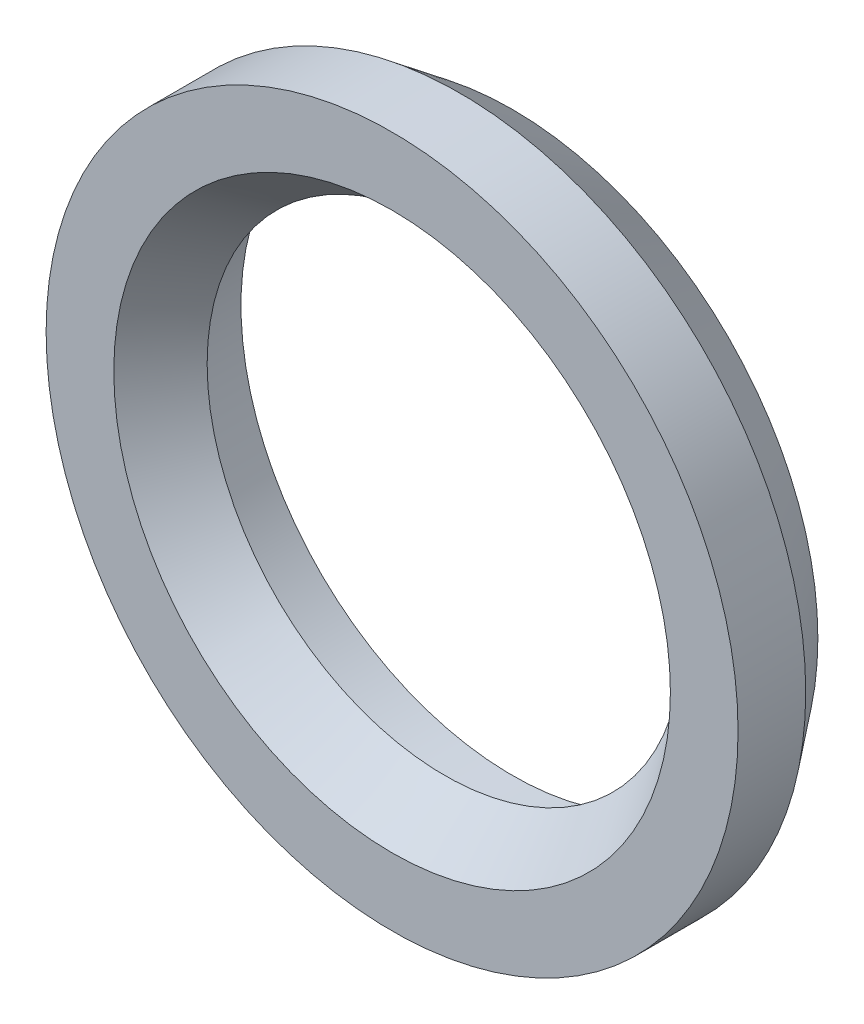
ISO-10303-21;
HEADER;
FILE_DESCRIPTION(('STEP AP214'),'2;1');
FILE_NAME('part.step','',(''),(''),'','','');
FILE_SCHEMA(('AUTOMOTIVE_DESIGN { 1 0 10303 214 1 1 1 1 }'));
ENDSEC;
DATA;
#1=APPLICATION_CONTEXT('core data for automotive mechanical design processes');
#2=APPLICATION_PROTOCOL_DEFINITION('international standard','automotive_design',2000,#1);
#3=PRODUCT_CONTEXT('',#1,'mechanical');
#4=PRODUCT('Part','Part','',(#3));
#5=PRODUCT_RELATED_PRODUCT_CATEGORY('part','',(#4));
#6=PRODUCT_DEFINITION_FORMATION('','',#4);
#7=PRODUCT_DEFINITION_CONTEXT('part definition',#1,'design');
#8=PRODUCT_DEFINITION('design','',#6,#7);
#9=PRODUCT_DEFINITION_SHAPE('','',#8);
#10=(LENGTH_UNIT() NAMED_UNIT(*) SI_UNIT(.MILLI.,.METRE.));
#11=(NAMED_UNIT(*) PLANE_ANGLE_UNIT() SI_UNIT($,.RADIAN.));
#12=(NAMED_UNIT(*) SI_UNIT($,.STERADIAN.) SOLID_ANGLE_UNIT());
#13=UNCERTAINTY_MEASURE_WITH_UNIT(LENGTH_MEASURE(1.E-05),#10,'distance_accuracy_value','');
#14=(GEOMETRIC_REPRESENTATION_CONTEXT(3) GLOBAL_UNCERTAINTY_ASSIGNED_CONTEXT((#13)) GLOBAL_UNIT_ASSIGNED_CONTEXT((#10,
#11,#12)) REPRESENTATION_CONTEXT('',''));
#15=CARTESIAN_POINT('',(0.,0.,0.));
#16=DIRECTION('',(0.,0.,1.));
#17=DIRECTION('',(1.,0.,0.));
#18=AXIS2_PLACEMENT_3D('',#15,#16,#17);
#19=CARTESIAN_POINT('',(0.,0.,-2.20512120815447));
#20=DIRECTION('',(0.,0.,1.));
#21=DIRECTION('',(1.,0.,0.));
#22=AXIS2_PLACEMENT_3D('',#19,#20,#21);
#23=CONICAL_SURFACE('',#22,51.125,0.656013056309412);
#24=CARTESIAN_POINT('',(0.,0.,-10.));
#25=DIRECTION('',(0.,0.,1.));
#26=DIRECTION('',(1.,0.,0.));
#27=AXIS2_PLACEMENT_3D('',#24,#25,#26);
#28=CIRCLE('',#27,45.125);
#29=CARTESIAN_POINT('',(45.125,0.,-10.));
#30=VERTEX_POINT('',#29);
#31=EDGE_CURVE('E68',#30,#30,#28,.T.);
#32=ORIENTED_EDGE('',*,*,#31,.T.);
#33=EDGE_LOOP('',(#32));
#34=FACE_BOUND('',#33,.T.);
#35=CARTESIAN_POINT('',(0.,0.,-2.20512120815447));
#36=DIRECTION('',(0.,0.,1.));
#37=DIRECTION('',(1.,0.,0.));
#38=AXIS2_PLACEMENT_3D('',#35,#36,#37);
#39=CIRCLE('',#38,51.125);
#40=CARTESIAN_POINT('',(51.125,0.,-2.20512120815447));
#41=VERTEX_POINT('',#40);
#42=EDGE_CURVE('E10',#41,#41,#39,.T.);
#43=ORIENTED_EDGE('',*,*,#42,.F.);
#44=EDGE_LOOP('',(#43));
#45=FACE_BOUND('',#44,.T.);
#46=ADVANCED_FACE('F37',(#34,#45),#23,.T.);
#47=CARTESIAN_POINT('',(0.,0.,0.));
#48=DIRECTION('',(0.,0.,1.));
#49=DIRECTION('',(1.,0.,0.));
#50=AXIS2_PLACEMENT_3D('',#47,#48,#49);
#51=CYLINDRICAL_SURFACE('',#50,51.125);
#52=ORIENTED_EDGE('',*,*,#42,.T.);
#53=EDGE_LOOP('',(#52));
#54=FACE_BOUND('',#53,.T.);
#55=CARTESIAN_POINT('',(0.,0.,7.79487879184553));
#56=DIRECTION('',(0.,0.,1.));
#57=DIRECTION('',(1.,0.,0.));
#58=AXIS2_PLACEMENT_3D('',#55,#56,#57);
#59=CIRCLE('',#58,51.125);
#60=CARTESIAN_POINT('',(51.125,0.,7.79487879184553));
#61=VERTEX_POINT('',#60);
#62=EDGE_CURVE('E44',#61,#61,#59,.T.);
#63=ORIENTED_EDGE('',*,*,#62,.F.);
#64=EDGE_LOOP('',(#63));
#65=FACE_BOUND('',#64,.T.);
#66=ADVANCED_FACE('F87',(#54,#65),#51,.T.);
#67=CARTESIAN_POINT('',(51.125,0.,7.79487879184553));
#68=DIRECTION('',(0.,0.,1.));
#69=DIRECTION('',(1.,0.,0.));
#70=AXIS2_PLACEMENT_3D('',#67,#68,#69);
#71=PLANE('',#70);
#72=ORIENTED_EDGE('',*,*,#62,.T.);
#73=EDGE_LOOP('',(#72));
#74=FACE_BOUND('',#73,.T.);
#75=CARTESIAN_POINT('',(0.,0.,7.79487879184553));
#76=DIRECTION('',(0.,0.,1.));
#77=DIRECTION('',(1.,0.,0.));
#78=AXIS2_PLACEMENT_3D('',#75,#76,#77);
#79=CIRCLE('',#78,41.125);
#80=CARTESIAN_POINT('',(41.125,0.,7.79487879184553));
#81=VERTEX_POINT('',#80);
#82=EDGE_CURVE('E49',#81,#81,#79,.T.);
#83=ORIENTED_EDGE('',*,*,#82,.F.);
#84=EDGE_LOOP('',(#83));
#85=FACE_BOUND('',#84,.T.);
#86=ADVANCED_FACE('F91',(#74,#85),#71,.T.);
#87=CARTESIAN_POINT('',(0.,0.,0.));
#88=DIRECTION('',(0.,0.,1.));
#89=DIRECTION('',(1.,0.,0.));
#90=AXIS2_PLACEMENT_3D('',#87,#88,#89);
#91=CONICAL_SURFACE('',#90,35.125,0.656013056309413);
#92=ORIENTED_EDGE('',*,*,#82,.T.);
#93=EDGE_LOOP('',(#92));
#94=FACE_BOUND('',#93,.T.);
#95=CARTESIAN_POINT('',(0.,0.,0.));
#96=DIRECTION('',(0.,0.,1.));
#97=DIRECTION('',(1.,0.,0.));
#98=AXIS2_PLACEMENT_3D('',#95,#96,#97);
#99=CIRCLE('',#98,35.125);
#100=CARTESIAN_POINT('',(35.125,0.,0.));
#101=VERTEX_POINT('',#100);
#102=EDGE_CURVE('E54',#101,#101,#99,.T.);
#103=ORIENTED_EDGE('',*,*,#102,.F.);
#104=EDGE_LOOP('',(#103));
#105=FACE_BOUND('',#104,.T.);
#106=ADVANCED_FACE('F95',(#94,#105),#91,.F.);
#107=CARTESIAN_POINT('',(35.125,0.,0.));
#108=DIRECTION('',(0.,0.,-1.));
#109=DIRECTION('',(-1.,0.,0.));
#110=AXIS2_PLACEMENT_3D('',#107,#108,#109);
#111=PLANE('',#110);
#112=ORIENTED_EDGE('',*,*,#102,.T.);
#113=EDGE_LOOP('',(#112));
#114=FACE_BOUND('',#113,.T.);
#115=CARTESIAN_POINT('',(0.,0.,0.));
#116=DIRECTION('',(0.,0.,1.));
#117=DIRECTION('',(1.,0.,0.));
#118=AXIS2_PLACEMENT_3D('',#115,#116,#117);
#119=CIRCLE('',#118,40.125);
#120=CARTESIAN_POINT('',(40.125,0.,0.));
#121=VERTEX_POINT('',#120);
#122=EDGE_CURVE('E60',#121,#121,#119,.T.);
#123=ORIENTED_EDGE('',*,*,#122,.F.);
#124=EDGE_LOOP('',(#123));
#125=FACE_BOUND('',#124,.T.);
#126=ADVANCED_FACE('F83',(#114,#125),#111,.T.);
#127=CARTESIAN_POINT('',(0.,0.,0.));
#128=DIRECTION('',(0.,0.,1.));
#129=DIRECTION('',(1.,0.,0.));
#130=AXIS2_PLACEMENT_3D('',#127,#128,#129);
#131=CYLINDRICAL_SURFACE('',#130,40.125);
#132=ORIENTED_EDGE('',*,*,#122,.T.);
#133=EDGE_LOOP('',(#132));
#134=FACE_BOUND('',#133,.T.);
#135=CARTESIAN_POINT('',(0.,0.,-10.));
#136=DIRECTION('',(0.,0.,1.));
#137=DIRECTION('',(1.,0.,0.));
#138=AXIS2_PLACEMENT_3D('',#135,#136,#137);
#139=CIRCLE('',#138,40.125);
#140=CARTESIAN_POINT('',(40.125,0.,-10.));
#141=VERTEX_POINT('',#140);
#142=EDGE_CURVE('E64',#141,#141,#139,.T.);
#143=ORIENTED_EDGE('',*,*,#142,.F.);
#144=EDGE_LOOP('',(#143));
#145=FACE_BOUND('',#144,.T.);
#146=ADVANCED_FACE('F77',(#134,#145),#131,.F.);
#147=CARTESIAN_POINT('',(40.125,0.,-10.));
#148=DIRECTION('',(0.,0.,-1.));
#149=DIRECTION('',(-1.,0.,0.));
#150=AXIS2_PLACEMENT_3D('',#147,#148,#149);
#151=PLANE('',#150);
#152=ORIENTED_EDGE('',*,*,#142,.T.);
#153=EDGE_LOOP('',(#152));
#154=FACE_BOUND('',#153,.T.);
#155=ORIENTED_EDGE('',*,*,#31,.F.);
#156=EDGE_LOOP('',(#155));
#157=FACE_BOUND('',#156,.T.);
#158=ADVANCED_FACE('F75',(#154,#157),#151,.T.);
#159=CLOSED_SHELL('',(#46,#66,#86,#106,#126,#146,#158));
#160=MANIFOLD_SOLID_BREP('B2',#159);
#161=ADVANCED_BREP_SHAPE_REPRESENTATION('',(#18,#160),#14);
#162=SHAPE_DEFINITION_REPRESENTATION(#9,#161);
ENDSEC;
END-ISO-10303-21;
